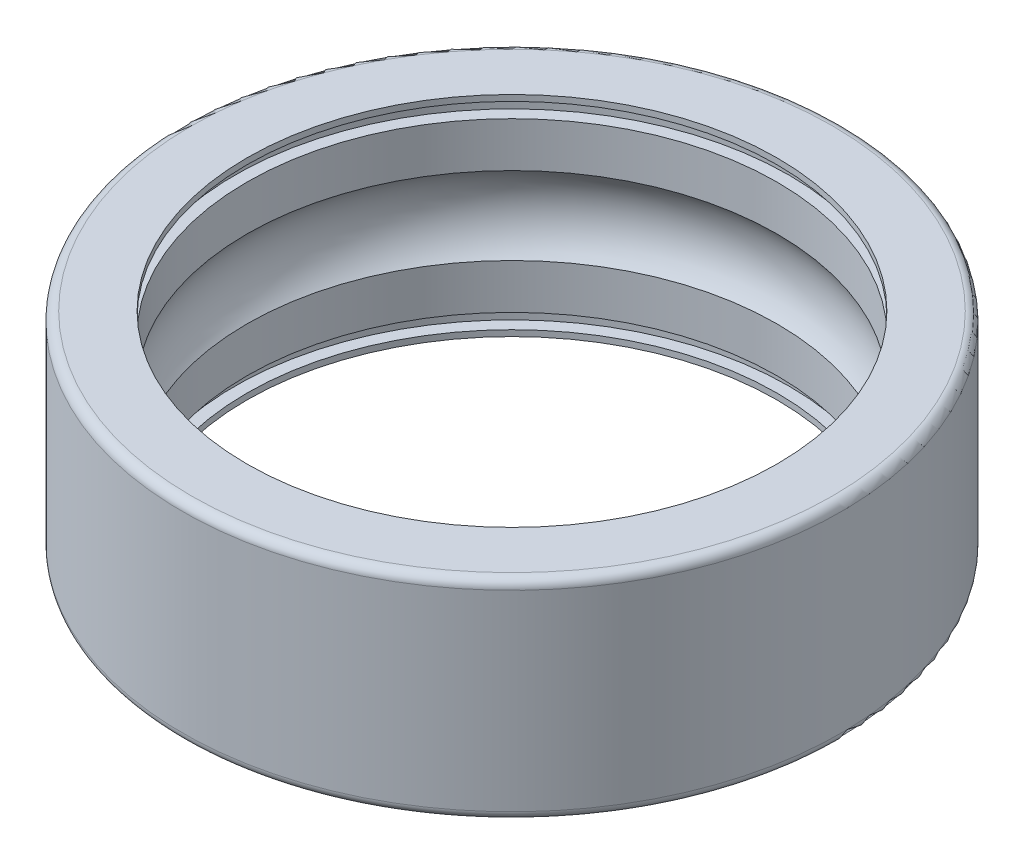
ISO-10303-21;
HEADER;
FILE_DESCRIPTION(('STEP AP214'),'2;1');
FILE_NAME('part.step','',(''),(''),'','','');
FILE_SCHEMA(('AUTOMOTIVE_DESIGN { 1 0 10303 214 1 1 1 1 }'));
ENDSEC;
DATA;
#1=APPLICATION_CONTEXT('core data for automotive mechanical design processes');
#2=APPLICATION_PROTOCOL_DEFINITION('international standard','automotive_design',2000,#1);
#3=PRODUCT_CONTEXT('',#1,'mechanical');
#4=PRODUCT('Part','Part','',(#3));
#5=PRODUCT_RELATED_PRODUCT_CATEGORY('part','',(#4));
#6=PRODUCT_DEFINITION_FORMATION('','',#4);
#7=PRODUCT_DEFINITION_CONTEXT('part definition',#1,'design');
#8=PRODUCT_DEFINITION('design','',#6,#7);
#9=PRODUCT_DEFINITION_SHAPE('','',#8);
#10=(LENGTH_UNIT() NAMED_UNIT(*) SI_UNIT(.MILLI.,.METRE.));
#11=(NAMED_UNIT(*) PLANE_ANGLE_UNIT() SI_UNIT($,.RADIAN.));
#12=(NAMED_UNIT(*) SI_UNIT($,.STERADIAN.) SOLID_ANGLE_UNIT());
#13=UNCERTAINTY_MEASURE_WITH_UNIT(LENGTH_MEASURE(1.E-05),#10,'distance_accuracy_value','');
#14=(GEOMETRIC_REPRESENTATION_CONTEXT(3) GLOBAL_UNCERTAINTY_ASSIGNED_CONTEXT((#13)) GLOBAL_UNIT_ASSIGNED_CONTEXT((#10,
#11,#12)) REPRESENTATION_CONTEXT('',''));
#15=CARTESIAN_POINT('',(0.,0.,0.));
#16=DIRECTION('',(0.,0.,1.));
#17=DIRECTION('',(1.,0.,0.));
#18=AXIS2_PLACEMENT_3D('',#15,#16,#17);
#19=CARTESIAN_POINT('',(0.,-3.85,0.));
#20=DIRECTION('',(0.,1.,0.));
#21=DIRECTION('',(0.,0.,-1.));
#22=AXIS2_PLACEMENT_3D('',#19,#20,#21);
#23=CYLINDRICAL_SURFACE('',#22,8.85);
#24=CARTESIAN_POINT('',(0.,-2.8,0.));
#25=DIRECTION('',(0.,-1.,0.));
#26=DIRECTION('',(0.,0.,1.));
#27=AXIS2_PLACEMENT_3D('',#24,#25,#26);
#28=CIRCLE('',#27,8.85);
#29=CARTESIAN_POINT('',(0.,-2.8,8.85));
#30=VERTEX_POINT('',#29);
#31=EDGE_CURVE('E11',#30,#30,#28,.T.);
#32=ORIENTED_EDGE('',*,*,#31,.T.);
#33=EDGE_LOOP('',(#32));
#34=FACE_BOUND('',#33,.T.);
#35=CARTESIAN_POINT('',(0.,-1.299899996154,0.));
#36=DIRECTION('',(0.,1.,0.));
#37=DIRECTION('',(0.,0.,-1.));
#38=AXIS2_PLACEMENT_3D('',#35,#36,#37);
#39=CIRCLE('',#38,8.85);
#40=CARTESIAN_POINT('',(0.,-1.299899996154,-8.85));
#41=VERTEX_POINT('',#40);
#42=EDGE_CURVE('E114',#41,#41,#39,.T.);
#43=ORIENTED_EDGE('',*,*,#42,.T.);
#44=EDGE_LOOP('',(#43));
#45=FACE_BOUND('',#44,.T.);
#46=ADVANCED_FACE('F17',(#34,#45),#23,.F.);
#47=CARTESIAN_POINT('',(0.,-2.8,0.));
#48=DIRECTION('',(0.,1.,0.));
#49=DIRECTION('',(1.,0.,0.));
#50=AXIS2_PLACEMENT_3D('',#47,#48,#49);
#51=PLANE('',#50);
#52=ORIENTED_EDGE('',*,*,#31,.F.);
#53=EDGE_LOOP('',(#52));
#54=FACE_BOUND('',#53,.T.);
#55=CARTESIAN_POINT('',(0.,-2.8,0.));
#56=DIRECTION('',(0.,1.,0.));
#57=DIRECTION('',(0.,0.,1.));
#58=AXIS2_PLACEMENT_3D('',#55,#56,#57);
#59=CIRCLE('',#58,9.25);
#60=CARTESIAN_POINT('',(0.,-2.8,9.25));
#61=VERTEX_POINT('',#60);
#62=EDGE_CURVE('E28',#61,#61,#59,.T.);
#63=ORIENTED_EDGE('',*,*,#62,.F.);
#64=EDGE_LOOP('',(#63));
#65=FACE_BOUND('',#64,.T.);
#66=ADVANCED_FACE('F160',(#54,#65),#51,.F.);
#67=CARTESIAN_POINT('',(0.,-3.85,0.));
#68=DIRECTION('',(0.,1.,0.));
#69=DIRECTION('',(0.,0.,-1.));
#70=AXIS2_PLACEMENT_3D('',#67,#68,#69);
#71=CYLINDRICAL_SURFACE('',#70,9.25);
#72=CARTESIAN_POINT('',(0.,-3.3,0.));
#73=DIRECTION('',(0.,-1.,0.));
#74=DIRECTION('',(0.,0.,1.));
#75=AXIS2_PLACEMENT_3D('',#72,#73,#74);
#76=CIRCLE('',#75,9.25);
#77=CARTESIAN_POINT('',(0.,-3.3,9.25));
#78=VERTEX_POINT('',#77);
#79=EDGE_CURVE('E91',#78,#78,#76,.T.);
#80=ORIENTED_EDGE('',*,*,#79,.T.);
#81=EDGE_LOOP('',(#80));
#82=FACE_BOUND('',#81,.T.);
#83=ORIENTED_EDGE('',*,*,#62,.T.);
#84=EDGE_LOOP('',(#83));
#85=FACE_BOUND('',#84,.T.);
#86=ADVANCED_FACE('F165',(#82,#85),#71,.F.);
#87=CARTESIAN_POINT('',(0.,-3.3,0.));
#88=DIRECTION('',(0.,1.,0.));
#89=DIRECTION('',(1.,0.,0.));
#90=AXIS2_PLACEMENT_3D('',#87,#88,#89);
#91=PLANE('',#90);
#92=CARTESIAN_POINT('',(0.,-3.3,0.));
#93=DIRECTION('',(0.,1.,0.));
#94=DIRECTION('',(0.,0.,1.));
#95=AXIS2_PLACEMENT_3D('',#92,#93,#94);
#96=CIRCLE('',#95,8.85);
#97=CARTESIAN_POINT('',(0.,-3.3,8.85));
#98=VERTEX_POINT('',#97);
#99=EDGE_CURVE('E87',#98,#98,#96,.T.);
#100=ORIENTED_EDGE('',*,*,#99,.F.);
#101=EDGE_LOOP('',(#100));
#102=FACE_BOUND('',#101,.T.);
#103=ORIENTED_EDGE('',*,*,#79,.F.);
#104=EDGE_LOOP('',(#103));
#105=FACE_BOUND('',#104,.T.);
#106=ADVANCED_FACE('F182',(#102,#105),#91,.T.);
#107=CARTESIAN_POINT('',(0.,-3.85,0.));
#108=DIRECTION('',(0.,1.,0.));
#109=DIRECTION('',(0.,0.,-1.));
#110=AXIS2_PLACEMENT_3D('',#107,#108,#109);
#111=CYLINDRICAL_SURFACE('',#110,8.85);
#112=CARTESIAN_POINT('',(0.,-3.5,0.));
#113=DIRECTION('',(0.,-1.,0.));
#114=DIRECTION('',(0.,0.,1.));
#115=AXIS2_PLACEMENT_3D('',#112,#113,#114);
#116=CIRCLE('',#115,8.85);
#117=CARTESIAN_POINT('',(0.,-3.5,8.85));
#118=VERTEX_POINT('',#117);
#119=EDGE_CURVE('E92',#118,#118,#116,.T.);
#120=ORIENTED_EDGE('',*,*,#119,.T.);
#121=EDGE_LOOP('',(#120));
#122=FACE_BOUND('',#121,.T.);
#123=ORIENTED_EDGE('',*,*,#99,.T.);
#124=EDGE_LOOP('',(#123));
#125=FACE_BOUND('',#124,.T.);
#126=ADVANCED_FACE('F88',(#122,#125),#111,.F.);
#127=CARTESIAN_POINT('',(0.,-3.5,0.));
#128=DIRECTION('',(0.,1.,0.));
#129=DIRECTION('',(1.,0.,0.));
#130=AXIS2_PLACEMENT_3D('',#127,#128,#129);
#131=PLANE('',#130);
#132=ORIENTED_EDGE('',*,*,#119,.F.);
#133=EDGE_LOOP('',(#132));
#134=FACE_BOUND('',#133,.T.);
#135=CARTESIAN_POINT('',(0.,-3.5,0.));
#136=DIRECTION('',(0.,1.,0.));
#137=DIRECTION('',(0.,0.,1.));
#138=AXIS2_PLACEMENT_3D('',#135,#136,#137);
#139=CIRCLE('',#138,10.7);
#140=CARTESIAN_POINT('',(0.,-3.5,10.7));
#141=VERTEX_POINT('',#140);
#142=EDGE_CURVE('E101',#141,#141,#139,.T.);
#143=ORIENTED_EDGE('',*,*,#142,.F.);
#144=EDGE_LOOP('',(#143));
#145=FACE_BOUND('',#144,.T.);
#146=ADVANCED_FACE('F174',(#134,#145),#131,.F.);
#147=CARTESIAN_POINT('',(0.,-3.2,0.));
#148=DIRECTION('',(0.,1.,0.));
#149=DIRECTION('',(0.,0.,-1.));
#150=AXIS2_PLACEMENT_3D('',#147,#148,#149);
#151=TOROIDAL_SURFACE('',#150,10.7,0.3);
#152=CARTESIAN_POINT('',(0.,-3.2,0.));
#153=DIRECTION('',(0.,1.,0.));
#154=DIRECTION('',(0.,0.,1.));
#155=AXIS2_PLACEMENT_3D('',#152,#153,#154);
#156=CIRCLE('',#155,11.);
#157=CARTESIAN_POINT('',(0.,-3.2,-11.));
#158=VERTEX_POINT('',#157);
#159=EDGE_CURVE('E128',#158,#158,#156,.T.);
#160=ORIENTED_EDGE('',*,*,#159,.F.);
#161=EDGE_LOOP('',(#160));
#162=FACE_BOUND('',#161,.T.);
#163=ORIENTED_EDGE('',*,*,#142,.T.);
#164=EDGE_LOOP('',(#163));
#165=FACE_BOUND('',#164,.T.);
#166=ADVANCED_FACE('F155',(#162,#165),#151,.T.);
#167=CARTESIAN_POINT('',(0.,-3.85,0.));
#168=DIRECTION('',(0.,1.,0.));
#169=DIRECTION('',(0.,0.,-1.));
#170=AXIS2_PLACEMENT_3D('',#167,#168,#169);
#171=CYLINDRICAL_SURFACE('',#170,11.);
#172=ORIENTED_EDGE('',*,*,#159,.T.);
#173=EDGE_LOOP('',(#172));
#174=FACE_BOUND('',#173,.T.);
#175=CARTESIAN_POINT('',(0.,3.2,0.));
#176=DIRECTION('',(0.,-1.,0.));
#177=DIRECTION('',(0.,0.,1.));
#178=AXIS2_PLACEMENT_3D('',#175,#176,#177);
#179=CIRCLE('',#178,11.);
#180=CARTESIAN_POINT('',(0.,3.2,-11.));
#181=VERTEX_POINT('',#180);
#182=EDGE_CURVE('E127',#181,#181,#179,.T.);
#183=ORIENTED_EDGE('',*,*,#182,.T.);
#184=EDGE_LOOP('',(#183));
#185=FACE_BOUND('',#184,.T.);
#186=ADVANCED_FACE('F139',(#174,#185),#171,.T.);
#187=CARTESIAN_POINT('',(0.,3.2,0.));
#188=DIRECTION('',(0.,1.,0.));
#189=DIRECTION('',(0.,0.,-1.));
#190=AXIS2_PLACEMENT_3D('',#187,#188,#189);
#191=TOROIDAL_SURFACE('',#190,10.7,0.3);
#192=CARTESIAN_POINT('',(0.,3.5,0.));
#193=DIRECTION('',(0.,-1.,0.));
#194=DIRECTION('',(0.,0.,1.));
#195=AXIS2_PLACEMENT_3D('',#192,#193,#194);
#196=CIRCLE('',#195,10.7);
#197=CARTESIAN_POINT('',(0.,3.5,10.7));
#198=VERTEX_POINT('',#197);
#199=EDGE_CURVE('E124',#198,#198,#196,.T.);
#200=ORIENTED_EDGE('',*,*,#199,.T.);
#201=EDGE_LOOP('',(#200));
#202=FACE_BOUND('',#201,.T.);
#203=ORIENTED_EDGE('',*,*,#182,.F.);
#204=EDGE_LOOP('',(#203));
#205=FACE_BOUND('',#204,.T.);
#206=ADVANCED_FACE('F142',(#202,#205),#191,.T.);
#207=CARTESIAN_POINT('',(0.,3.5,0.));
#208=DIRECTION('',(0.,1.,0.));
#209=DIRECTION('',(1.,0.,0.));
#210=AXIS2_PLACEMENT_3D('',#207,#208,#209);
#211=PLANE('',#210);
#212=CARTESIAN_POINT('',(0.,3.5,0.));
#213=DIRECTION('',(0.,1.,0.));
#214=DIRECTION('',(0.,0.,1.));
#215=AXIS2_PLACEMENT_3D('',#212,#213,#214);
#216=CIRCLE('',#215,8.85);
#217=CARTESIAN_POINT('',(0.,3.5,8.85));
#218=VERTEX_POINT('',#217);
#219=EDGE_CURVE('E120',#218,#218,#216,.T.);
#220=ORIENTED_EDGE('',*,*,#219,.F.);
#221=EDGE_LOOP('',(#220));
#222=FACE_BOUND('',#221,.T.);
#223=ORIENTED_EDGE('',*,*,#199,.F.);
#224=EDGE_LOOP('',(#223));
#225=FACE_BOUND('',#224,.T.);
#226=ADVANCED_FACE('F144',(#222,#225),#211,.T.);
#227=CARTESIAN_POINT('',(0.,-3.85,0.));
#228=DIRECTION('',(0.,1.,0.));
#229=DIRECTION('',(0.,0.,-1.));
#230=AXIS2_PLACEMENT_3D('',#227,#228,#229);
#231=CYLINDRICAL_SURFACE('',#230,8.85);
#232=CARTESIAN_POINT('',(0.,3.3,0.));
#233=DIRECTION('',(0.,-1.,0.));
#234=DIRECTION('',(0.,0.,1.));
#235=AXIS2_PLACEMENT_3D('',#232,#233,#234);
#236=CIRCLE('',#235,8.85);
#237=CARTESIAN_POINT('',(0.,3.3,8.85));
#238=VERTEX_POINT('',#237);
#239=EDGE_CURVE('E112',#238,#238,#236,.T.);
#240=ORIENTED_EDGE('',*,*,#239,.T.);
#241=EDGE_LOOP('',(#240));
#242=FACE_BOUND('',#241,.T.);
#243=ORIENTED_EDGE('',*,*,#219,.T.);
#244=EDGE_LOOP('',(#243));
#245=FACE_BOUND('',#244,.T.);
#246=ADVANCED_FACE('F152',(#242,#245),#231,.F.);
#247=CARTESIAN_POINT('',(0.,3.3,0.));
#248=DIRECTION('',(0.,1.,0.));
#249=DIRECTION('',(1.,0.,0.));
#250=AXIS2_PLACEMENT_3D('',#247,#248,#249);
#251=PLANE('',#250);
#252=ORIENTED_EDGE('',*,*,#239,.F.);
#253=EDGE_LOOP('',(#252));
#254=FACE_BOUND('',#253,.T.);
#255=CARTESIAN_POINT('',(0.,3.3,0.));
#256=DIRECTION('',(0.,1.,0.));
#257=DIRECTION('',(0.,0.,1.));
#258=AXIS2_PLACEMENT_3D('',#255,#256,#257);
#259=CIRCLE('',#258,9.25);
#260=CARTESIAN_POINT('',(0.,3.3,9.25));
#261=VERTEX_POINT('',#260);
#262=EDGE_CURVE('E108',#261,#261,#259,.T.);
#263=ORIENTED_EDGE('',*,*,#262,.F.);
#264=EDGE_LOOP('',(#263));
#265=FACE_BOUND('',#264,.T.);
#266=ADVANCED_FACE('F179',(#254,#265),#251,.F.);
#267=CARTESIAN_POINT('',(0.,-3.85,0.));
#268=DIRECTION('',(0.,1.,0.));
#269=DIRECTION('',(0.,0.,-1.));
#270=AXIS2_PLACEMENT_3D('',#267,#268,#269);
#271=CYLINDRICAL_SURFACE('',#270,9.25);
#272=CARTESIAN_POINT('',(0.,2.8,0.));
#273=DIRECTION('',(0.,-1.,0.));
#274=DIRECTION('',(0.,0.,1.));
#275=AXIS2_PLACEMENT_3D('',#272,#273,#274);
#276=CIRCLE('',#275,9.25);
#277=CARTESIAN_POINT('',(0.,2.8,9.25));
#278=VERTEX_POINT('',#277);
#279=EDGE_CURVE('E113',#278,#278,#276,.T.);
#280=ORIENTED_EDGE('',*,*,#279,.T.);
#281=EDGE_LOOP('',(#280));
#282=FACE_BOUND('',#281,.T.);
#283=ORIENTED_EDGE('',*,*,#262,.T.);
#284=EDGE_LOOP('',(#283));
#285=FACE_BOUND('',#284,.T.);
#286=ADVANCED_FACE('F19',(#282,#285),#271,.F.);
#287=CARTESIAN_POINT('',(0.,2.8,0.));
#288=DIRECTION('',(0.,1.,0.));
#289=DIRECTION('',(1.,0.,0.));
#290=AXIS2_PLACEMENT_3D('',#287,#288,#289);
#291=PLANE('',#290);
#292=CARTESIAN_POINT('',(0.,2.8,0.));
#293=DIRECTION('',(0.,1.,0.));
#294=DIRECTION('',(0.,0.,1.));
#295=AXIS2_PLACEMENT_3D('',#292,#293,#294);
#296=CIRCLE('',#295,8.85);
#297=CARTESIAN_POINT('',(0.,2.8,-8.85));
#298=VERTEX_POINT('',#297);
#299=EDGE_CURVE('E117',#298,#298,#296,.T.);
#300=ORIENTED_EDGE('',*,*,#299,.F.);
#301=EDGE_LOOP('',(#300));
#302=FACE_BOUND('',#301,.T.);
#303=ORIENTED_EDGE('',*,*,#279,.F.);
#304=EDGE_LOOP('',(#303));
#305=FACE_BOUND('',#304,.T.);
#306=ADVANCED_FACE('F184',(#302,#305),#291,.T.);
#307=CARTESIAN_POINT('',(0.,-3.85,0.));
#308=DIRECTION('',(0.,1.,0.));
#309=DIRECTION('',(0.,0.,-1.));
#310=AXIS2_PLACEMENT_3D('',#307,#308,#309);
#311=CYLINDRICAL_SURFACE('',#310,8.85);
#312=ORIENTED_EDGE('',*,*,#299,.T.);
#313=EDGE_LOOP('',(#312));
#314=FACE_BOUND('',#313,.T.);
#315=CARTESIAN_POINT('',(0.,1.299899996154,0.));
#316=DIRECTION('',(0.,-1.,0.));
#317=DIRECTION('',(0.,0.,1.));
#318=AXIS2_PLACEMENT_3D('',#315,#316,#317);
#319=CIRCLE('',#318,8.85);
#320=CARTESIAN_POINT('',(0.,1.299899996154,-8.85));
#321=VERTEX_POINT('',#320);
#322=EDGE_CURVE('E21',#321,#321,#319,.T.);
#323=ORIENTED_EDGE('',*,*,#322,.T.);
#324=EDGE_LOOP('',(#323));
#325=FACE_BOUND('',#324,.T.);
#326=ADVANCED_FACE('F170',(#314,#325),#311,.F.);
#327=CARTESIAN_POINT('',(0.,0.,0.));
#328=DIRECTION('',(0.,1.,0.));
#329=DIRECTION('',(0.,0.,-1.));
#330=AXIS2_PLACEMENT_3D('',#327,#328,#329);
#331=TOROIDAL_SURFACE('',#330,7.3505,1.9845);
#332=ORIENTED_EDGE('',*,*,#42,.F.);
#333=EDGE_LOOP('',(#332));
#334=FACE_BOUND('',#333,.T.);
#335=ORIENTED_EDGE('',*,*,#322,.F.);
#336=EDGE_LOOP('',(#335));
#337=FACE_BOUND('',#336,.T.);
#338=ADVANCED_FACE('F191',(#334,#337),#331,.F.);
#339=CLOSED_SHELL('',(#46,#66,#86,#106,#126,#146,#166,#186,#206,#226,#246,#266,#286,#306,#326,#338));
#340=MANIFOLD_SOLID_BREP('B1',#339);
#341=ADVANCED_BREP_SHAPE_REPRESENTATION('',(#18,#340),#14);
#342=SHAPE_DEFINITION_REPRESENTATION(#9,#341);
ENDSEC;
END-ISO-10303-21;
